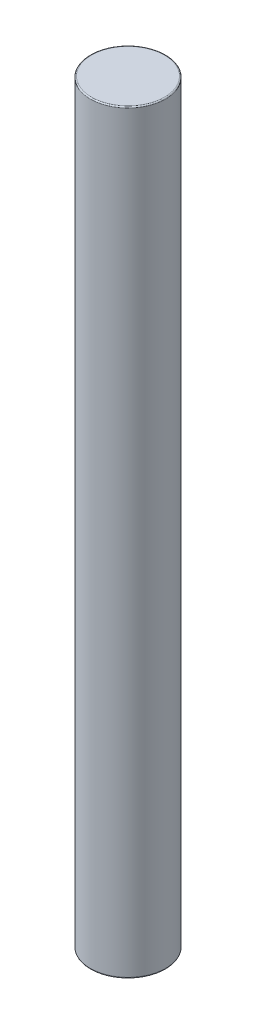
ISO-10303-21;
HEADER;
FILE_DESCRIPTION(('STEP AP214'),'2;1');
FILE_NAME('part.step','',(''),(''),'','','');
FILE_SCHEMA(('AUTOMOTIVE_DESIGN { 1 0 10303 214 1 1 1 1 }'));
ENDSEC;
DATA;
#1=APPLICATION_CONTEXT('core data for automotive mechanical design processes');
#2=APPLICATION_PROTOCOL_DEFINITION('international standard','automotive_design',2000,#1);
#3=PRODUCT_CONTEXT('',#1,'mechanical');
#4=PRODUCT('Part','Part','',(#3));
#5=PRODUCT_RELATED_PRODUCT_CATEGORY('part','',(#4));
#6=PRODUCT_DEFINITION_FORMATION('','',#4);
#7=PRODUCT_DEFINITION_CONTEXT('part definition',#1,'design');
#8=PRODUCT_DEFINITION('design','',#6,#7);
#9=PRODUCT_DEFINITION_SHAPE('','',#8);
#10=(LENGTH_UNIT() NAMED_UNIT(*) SI_UNIT(.MILLI.,.METRE.));
#11=(NAMED_UNIT(*) PLANE_ANGLE_UNIT() SI_UNIT($,.RADIAN.));
#12=(NAMED_UNIT(*) SI_UNIT($,.STERADIAN.) SOLID_ANGLE_UNIT());
#13=UNCERTAINTY_MEASURE_WITH_UNIT(LENGTH_MEASURE(1.E-05),#10,'distance_accuracy_value','');
#14=(GEOMETRIC_REPRESENTATION_CONTEXT(3) GLOBAL_UNCERTAINTY_ASSIGNED_CONTEXT((#13)) GLOBAL_UNIT_ASSIGNED_CONTEXT((#10,
#11,#12)) REPRESENTATION_CONTEXT('',''));
#15=CARTESIAN_POINT('',(0.,0.,0.));
#16=DIRECTION('',(0.,0.,1.));
#17=DIRECTION('',(1.,0.,0.));
#18=AXIS2_PLACEMENT_3D('',#15,#16,#17);
#19=CARTESIAN_POINT('',(0.,32.1,0.));
#20=DIRECTION('',(0.,-1.,0.));
#21=DIRECTION('',(0.,0.,-1.));
#22=AXIS2_PLACEMENT_3D('',#19,#20,#21);
#23=CYLINDRICAL_SURFACE('',#22,1.6);
#24=CARTESIAN_POINT('',(0.,0.0500000000000014,0.));
#25=DIRECTION('',(0.,1.,0.));
#26=DIRECTION('',(0.,0.,1.));
#27=AXIS2_PLACEMENT_3D('',#24,#25,#26);
#28=CIRCLE('',#27,1.6);
#29=CARTESIAN_POINT('',(0.,0.0500000000000014,1.6));
#30=VERTEX_POINT('',#29);
#31=EDGE_CURVE('E39',#30,#30,#28,.T.);
#32=ORIENTED_EDGE('',*,*,#31,.T.);
#33=EDGE_LOOP('',(#32));
#34=FACE_BOUND('',#33,.T.);
#35=CARTESIAN_POINT('',(0.,32.05,0.));
#36=DIRECTION('',(0.,1.,0.));
#37=DIRECTION('',(0.,0.,1.));
#38=AXIS2_PLACEMENT_3D('',#35,#36,#37);
#39=CIRCLE('',#38,1.6);
#40=CARTESIAN_POINT('',(0.,32.05,1.6));
#41=VERTEX_POINT('',#40);
#42=EDGE_CURVE('E43',#41,#41,#39,.F.);
#43=ORIENTED_EDGE('',*,*,#42,.T.);
#44=EDGE_LOOP('',(#43));
#45=FACE_BOUND('',#44,.T.);
#46=ADVANCED_FACE('F28',(#34,#45),#23,.T.);
#47=CARTESIAN_POINT('',(0.,32.1,0.));
#48=DIRECTION('',(0.,1.,0.));
#49=DIRECTION('',(0.,0.,1.));
#50=AXIS2_PLACEMENT_3D('',#47,#48,#49);
#51=PLANE('',#50);
#52=CARTESIAN_POINT('',(0.,32.1,0.));
#53=DIRECTION('',(0.,1.,0.));
#54=DIRECTION('',(0.,0.,1.));
#55=AXIS2_PLACEMENT_3D('',#52,#53,#54);
#56=CIRCLE('',#55,1.55);
#57=CARTESIAN_POINT('',(0.,32.1,1.55));
#58=VERTEX_POINT('',#57);
#59=EDGE_CURVE('E10',#58,#58,#56,.T.);
#60=ORIENTED_EDGE('',*,*,#59,.T.);
#61=EDGE_LOOP('',(#60));
#62=FACE_BOUND('',#61,.T.);
#63=ADVANCED_FACE('F59',(#62),#51,.T.);
#64=CARTESIAN_POINT('',(0.,0.,0.));
#65=DIRECTION('',(0.,1.,0.));
#66=DIRECTION('',(0.,0.,1.));
#67=AXIS2_PLACEMENT_3D('',#64,#65,#66);
#68=PLANE('',#67);
#69=CARTESIAN_POINT('',(0.,0.,0.));
#70=DIRECTION('',(0.,1.,0.));
#71=DIRECTION('',(0.,0.,1.));
#72=AXIS2_PLACEMENT_3D('',#69,#70,#71);
#73=CIRCLE('',#72,1.55);
#74=CARTESIAN_POINT('',(0.,0.,1.55));
#75=VERTEX_POINT('',#74);
#76=EDGE_CURVE('E35',#75,#75,#73,.F.);
#77=ORIENTED_EDGE('',*,*,#76,.T.);
#78=EDGE_LOOP('',(#77));
#79=FACE_BOUND('',#78,.T.);
#80=ADVANCED_FACE('F56',(#79),#68,.F.);
#81=CARTESIAN_POINT('',(0.,0.0500000000000014,0.));
#82=DIRECTION('',(0.,1.,0.));
#83=DIRECTION('',(0.,0.,1.));
#84=AXIS2_PLACEMENT_3D('',#81,#82,#83);
#85=TOROIDAL_SURFACE('',#84,1.55,0.05);
#86=ORIENTED_EDGE('',*,*,#76,.F.);
#87=EDGE_LOOP('',(#86));
#88=FACE_BOUND('',#87,.T.);
#89=ORIENTED_EDGE('',*,*,#31,.F.);
#90=EDGE_LOOP('',(#89));
#91=FACE_BOUND('',#90,.T.);
#92=ADVANCED_FACE('F52',(#88,#91),#85,.T.);
#93=CARTESIAN_POINT('',(0.,32.05,0.));
#94=DIRECTION('',(0.,1.,0.));
#95=DIRECTION('',(0.,0.,1.));
#96=AXIS2_PLACEMENT_3D('',#93,#94,#95);
#97=TOROIDAL_SURFACE('',#96,1.55,0.05);
#98=ORIENTED_EDGE('',*,*,#42,.F.);
#99=EDGE_LOOP('',(#98));
#100=FACE_BOUND('',#99,.T.);
#101=ORIENTED_EDGE('',*,*,#59,.F.);
#102=EDGE_LOOP('',(#101));
#103=FACE_BOUND('',#102,.T.);
#104=ADVANCED_FACE('F30',(#100,#103),#97,.T.);
#105=CLOSED_SHELL('',(#46,#63,#80,#92,#104));
#106=MANIFOLD_SOLID_BREP('B2',#105);
#107=ADVANCED_BREP_SHAPE_REPRESENTATION('',(#18,#106),#14);
#108=SHAPE_DEFINITION_REPRESENTATION(#9,#107);
ENDSEC;
END-ISO-10303-21;
